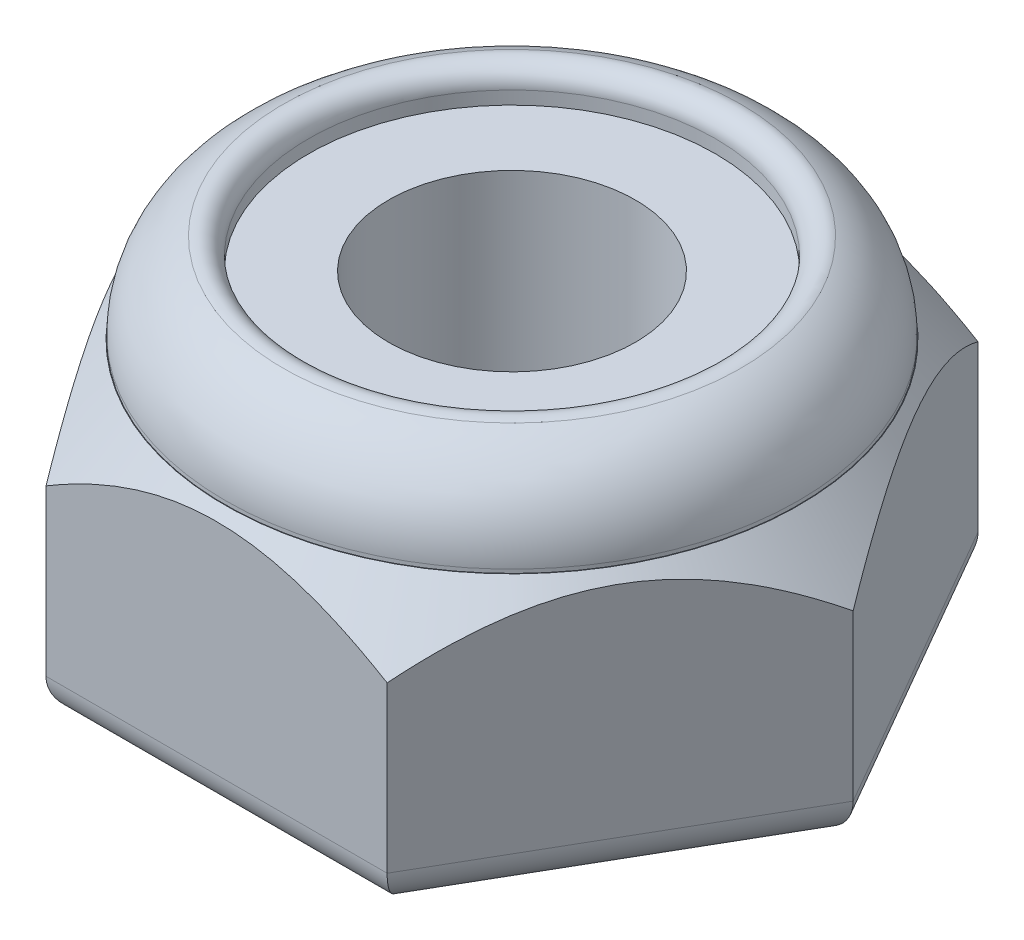
ISO-10303-21;
HEADER;
FILE_DESCRIPTION(('STEP AP214'),'2;1');
FILE_NAME('part.step','',(''),(''),'','','');
FILE_SCHEMA(('AUTOMOTIVE_DESIGN { 1 0 10303 214 1 1 1 1 }'));
ENDSEC;
DATA;
#1=APPLICATION_CONTEXT('core data for automotive mechanical design processes');
#2=APPLICATION_PROTOCOL_DEFINITION('international standard','automotive_design',2000,#1);
#3=PRODUCT_CONTEXT('',#1,'mechanical');
#4=PRODUCT('Part','Part','',(#3));
#5=PRODUCT_RELATED_PRODUCT_CATEGORY('part','',(#4));
#6=PRODUCT_DEFINITION_FORMATION('','',#4);
#7=PRODUCT_DEFINITION_CONTEXT('part definition',#1,'design');
#8=PRODUCT_DEFINITION('design','',#6,#7);
#9=PRODUCT_DEFINITION_SHAPE('','',#8);
#10=(LENGTH_UNIT() NAMED_UNIT(*) SI_UNIT(.MILLI.,.METRE.));
#11=(NAMED_UNIT(*) PLANE_ANGLE_UNIT() SI_UNIT($,.RADIAN.));
#12=(NAMED_UNIT(*) SI_UNIT($,.STERADIAN.) SOLID_ANGLE_UNIT());
#13=UNCERTAINTY_MEASURE_WITH_UNIT(LENGTH_MEASURE(1.E-05),#10,'distance_accuracy_value','');
#14=(GEOMETRIC_REPRESENTATION_CONTEXT(3) GLOBAL_UNCERTAINTY_ASSIGNED_CONTEXT((#13)) GLOBAL_UNIT_ASSIGNED_CONTEXT((#10,
#11,#12)) REPRESENTATION_CONTEXT('',''));
#15=CARTESIAN_POINT('',(0.,0.,0.));
#16=DIRECTION('',(0.,0.,1.));
#17=DIRECTION('',(1.,0.,0.));
#18=AXIS2_PLACEMENT_3D('',#15,#16,#17);
#19=CARTESIAN_POINT('',(0.,4.9784,0.));
#20=DIRECTION('',(0.,-1.,0.));
#21=DIRECTION('',(0.,0.,-1.));
#22=AXIS2_PLACEMENT_3D('',#19,#20,#21);
#23=CYLINDRICAL_SURFACE('',#22,3.937);
#24=CARTESIAN_POINT('',(0.,3.7084,0.));
#25=DIRECTION('',(0.,1.,0.));
#26=DIRECTION('',(0.,0.,1.));
#27=AXIS2_PLACEMENT_3D('',#24,#25,#26);
#28=CIRCLE('',#27,3.937);
#29=CARTESIAN_POINT('',(0.,3.7084,3.937));
#30=VERTEX_POINT('',#29);
#31=EDGE_CURVE('E243',#30,#30,#28,.T.);
#32=ORIENTED_EDGE('',*,*,#31,.F.);
#33=EDGE_LOOP('',(#32));
#34=FACE_BOUND('',#33,.T.);
#35=CARTESIAN_POINT('',(0.,3.6576,0.));
#36=DIRECTION('',(0.,-1.,0.));
#37=DIRECTION('',(0.,0.,-1.));
#38=AXIS2_PLACEMENT_3D('',#35,#36,#37);
#39=CIRCLE('',#38,3.937);
#40=CARTESIAN_POINT('',(0.,3.6576,-3.937));
#41=VERTEX_POINT('',#40);
#42=EDGE_CURVE('E19',#41,#41,#39,.F.);
#43=ORIENTED_EDGE('',*,*,#42,.T.);
#44=EDGE_LOOP('',(#43));
#45=FACE_BOUND('',#44,.T.);
#46=ADVANCED_FACE('F16',(#34,#45),#23,.T.);
#47=CARTESIAN_POINT('',(0.,3.7084,0.));
#48=DIRECTION('',(0.,1.,0.));
#49=DIRECTION('',(0.,0.,1.));
#50=AXIS2_PLACEMENT_3D('',#47,#48,#49);
#51=TOROIDAL_SURFACE('',#50,2.667,1.27);
#52=ORIENTED_EDGE('',*,*,#31,.T.);
#53=EDGE_LOOP('',(#52));
#54=FACE_BOUND('',#53,.T.);
#55=CARTESIAN_POINT('',(0.,4.88572150982644,0.));
#56=DIRECTION('',(0.,-1.,0.));
#57=DIRECTION('',(0.,0.,-1.));
#58=AXIS2_PLACEMENT_3D('',#55,#56,#57);
#59=CIRCLE('',#58,3.14325);
#60=CARTESIAN_POINT('',(0.,4.88572150982644,-3.14325));
#61=VERTEX_POINT('',#60);
#62=EDGE_CURVE('E237',#61,#61,#59,.F.);
#63=ORIENTED_EDGE('',*,*,#62,.F.);
#64=EDGE_LOOP('',(#63));
#65=FACE_BOUND('',#64,.T.);
#66=ADVANCED_FACE('F134',(#54,#65),#51,.T.);
#67=CARTESIAN_POINT('',(2.34315,3.6576,4.05845484975502));
#68=DIRECTION('',(0.,-1.,0.));
#69=DIRECTION('',(0.,0.,-1.));
#70=AXIS2_PLACEMENT_3D('',#67,#68,#69);
#71=PLANE('',#70);
#72=ORIENTED_EDGE('',*,*,#42,.F.);
#73=EDGE_LOOP('',(#72));
#74=FACE_BOUND('',#73,.T.);
#75=CARTESIAN_POINT('',(0.,3.65760000011051,0.));
#76=DIRECTION('',(0.,-1.,0.));
#77=DIRECTION('',(0.,0.,-1.));
#78=AXIS2_PLACEMENT_3D('',#75,#76,#77);
#79=CIRCLE('',#78,3.94407100938664);
#80=CARTESIAN_POINT('',(0.,3.65760000011051,-3.94407100938664));
#81=VERTEX_POINT('',#80);
#82=EDGE_CURVE('E119',#81,#81,#79,.T.);
#83=ORIENTED_EDGE('',*,*,#82,.F.);
#84=EDGE_LOOP('',(#83));
#85=FACE_BOUND('',#84,.T.);
#86=ADVANCED_FACE('F129',(#74,#85),#71,.F.);
#87=CARTESIAN_POINT('',(0.,4.65025720786115,0.));
#88=DIRECTION('',(0.,-1.,0.));
#89=DIRECTION('',(0.,0.,-1.));
#90=AXIS2_PLACEMENT_3D('',#87,#88,#89);
#91=TOROIDAL_SURFACE('',#90,3.048,0.254);
#92=CARTESIAN_POINT('',(0.,4.65025720786115,0.));
#93=DIRECTION('',(0.,1.,0.));
#94=DIRECTION('',(0.,0.,1.));
#95=AXIS2_PLACEMENT_3D('',#92,#93,#94);
#96=CIRCLE('',#95,2.794);
#97=CARTESIAN_POINT('',(0.,4.65025720786115,2.794));
#98=VERTEX_POINT('',#97);
#99=EDGE_CURVE('E104',#98,#98,#96,.F.);
#100=ORIENTED_EDGE('',*,*,#99,.T.);
#101=EDGE_LOOP('',(#100));
#102=FACE_BOUND('',#101,.T.);
#103=ORIENTED_EDGE('',*,*,#62,.T.);
#104=EDGE_LOOP('',(#103));
#105=FACE_BOUND('',#104,.T.);
#106=ADVANCED_FACE('F125',(#102,#105),#91,.T.);
#107=CARTESIAN_POINT('',(0.,2.76773860969115,0.));
#108=DIRECTION('',(0.,-1.,0.));
#109=DIRECTION('',(0.,0.,-1.));
#110=AXIS2_PLACEMENT_3D('',#107,#108,#109);
#111=CONICAL_SURFACE('',#110,4.69075337389313,0.698131700802158);
#112=CARTESIAN_POINT('',(-4.68630000001476,2.77304593398821,-5.3333815551093E-11));
#113=CARTESIAN_POINT('',(-4.65177717141793,2.81418235889091,0.0597952931149053));
#114=CARTESIAN_POINT('',(-4.61695780288956,2.85432113110728,0.120104208500933));
#115=CARTESIAN_POINT('',(-4.54666264441453,2.93230661020916,0.241858994511412));
#116=CARTESIAN_POINT('',(-4.51118655194523,2.97015222462005,0.303305389120424));
#117=CARTESIAN_POINT('',(-4.40329561885259,3.08018701500149,0.490177966909938));
#118=CARTESIAN_POINT('',(-4.32983334004397,3.14837015576205,0.617418366247689));
#119=CARTESIAN_POINT('',(-4.1797796499728,3.27092778609509,0.877318981315214));
#120=CARTESIAN_POINT('',(-4.10317943932402,3.32525984886677,1.00999443802899));
#121=CARTESIAN_POINT('',(-3.94747591651278,3.41577217646147,1.27968085045525));
#122=CARTESIAN_POINT('',(-3.86837998243724,3.45200143013375,1.4166790269463));
#123=CARTESIAN_POINT('',(-3.73746585196202,3.49372811243502,1.64342895235813));
#124=CARTESIAN_POINT('',(-3.68614686019516,3.50560413715319,1.73231605349153));
#125=CARTESIAN_POINT('',(-3.58316406708587,3.52008140702852,1.91068748346216));
#126=CARTESIAN_POINT('',(-3.53150020834088,3.5226810675312,2.00017191172355));
#127=CARTESIAN_POINT('',(-3.42855034551142,3.51847006524789,2.17848630477643));
#128=CARTESIAN_POINT('',(-3.3772638088531,3.51171021118305,2.26731719201287));
#129=CARTESIAN_POINT('',(-3.27519197708947,3.48921023555424,2.4441107906491));
#130=CARTESIAN_POINT('',(-3.22440670715057,3.4734696654174,2.53207345845939));
#131=CARTESIAN_POINT('',(-3.10963060134479,3.42817062222156,2.73087150520989));
#132=CARTESIAN_POINT('',(-3.04589899577138,3.39598542076133,2.84125788411098));
#133=CARTESIAN_POINT('',(-2.92018166739655,3.32004827846255,3.05900668424801));
#134=CARTESIAN_POINT('',(-2.85819691962206,3.27629001415058,3.16636741668776));
#135=CARTESIAN_POINT('',(-2.735889068299,3.17910361386979,3.37821082934389));
#136=CARTESIAN_POINT('',(-2.67557364738244,3.12563730731956,3.48268020285126));
#137=CARTESIAN_POINT('',(-2.55683004320588,3.01104764609313,3.68835015835892));
#138=CARTESIAN_POINT('',(-2.49840123089761,2.94992687749399,3.78955182990274));
#139=CARTESIAN_POINT('',(-2.42439626092569,2.86741854625153,3.91773219790672));
#140=CARTESIAN_POINT('',(-2.40802320106583,2.84883596648691,3.94609116945937));
#141=CARTESIAN_POINT('',(-2.3754621576302,2.81125673907332,4.00248855103733));
#142=CARTESIAN_POINT('',(-2.35927376441604,2.79226151161516,4.03052767057717));
#143=CARTESIAN_POINT('',(-2.3431499999717,2.77304593399368,4.05845484980404));
#144=B_SPLINE_CURVE_WITH_KNOTS('',3,(#112,#113,#114,#115,#116,#117,#118,#119,#120,#121,#122,
#123,#124,#125,#126,#127,#128,#129,#130,#131,#132,#133,#134,#135,#136,#137,#138,#139,#140,#141,
#142,#143),.UNSPECIFIED.,.F.,.F.,(4,2,2,2,2,2,2,2,2,2,2,2,2,2,2,4),(0.,0.241096809088565,
0.48230758945251,0.967637153847365,1.45443592242802,1.93991010956963,2.24950193433618,
2.5591466432483,2.86711700071403,3.17510274216898,3.56882084711336,3.96275452403261,
4.35827201930639,4.75365624679115,4.86660838982693,4.97921936905084),.UNSPECIFIED.);
#145=CARTESIAN_POINT('',(-4.68630000002839,2.77304593399358,0.));
#146=VERTEX_POINT('',#145);
#147=CARTESIAN_POINT('',(-2.34315000001419,2.77304593399358,4.05845484977959));
#148=VERTEX_POINT('',#147);
#149=EDGE_CURVE('E91',#146,#148,#144,.T.);
#150=ORIENTED_EDGE('',*,*,#149,.T.);
#151=CARTESIAN_POINT('',(-2.34315000005357,2.77304593398822,4.05845484974113));
#152=CARTESIAN_POINT('',(-2.27415972170409,2.81414935271336,4.05845484974989));
#153=CARTESIAN_POINT('',(-2.20457738522044,2.85425669884705,4.05845484975361));
#154=CARTESIAN_POINT('',(-2.06410193528096,2.93218331968193,4.05845484975642));
#155=CARTESIAN_POINT('',(-1.99320821641151,2.9700015013142,4.05845484975551));
#156=CARTESIAN_POINT('',(-1.77754688772429,3.07999086386455,4.05845484975401));
#157=CARTESIAN_POINT('',(-1.63068545869954,3.1481589403704,4.05845484975469));
#158=CARTESIAN_POINT('',(-1.33052752457963,3.27077676919262,4.05845484975534));
#159=CARTESIAN_POINT('',(-1.17720631609342,3.32516696804196,4.0584548497553));
#160=CARTESIAN_POINT('',(-0.865613503807779,3.41574608766059,4.05845484975473));
#161=CARTESIAN_POINT('',(-0.707359229311903,3.45199244874899,4.0584548497542));
#162=CARTESIAN_POINT('',(-0.456822143345071,3.49192146546895,4.05845484975548));
#163=CARTESIAN_POINT('',(-0.365672921156202,3.50290887295604,4.05845484975637));
#164=CARTESIAN_POINT('',(-0.183016322004482,3.51758027913678,4.05845484975366));
#165=CARTESIAN_POINT('',(-0.0915105175250817,3.52128341037061,4.05845484975007));
#166=CARTESIAN_POINT('',(0.104649468641441,3.52128177491765,4.0584548497495));
#167=CARTESIAN_POINT('',(0.209305100872023,3.51643705333648,4.05845484975354));
#168=CARTESIAN_POINT('',(0.417787181909869,3.49730239560235,4.05845484975649));
#169=CARTESIAN_POINT('',(0.521613181352877,3.48300765111694,4.05845484975541));
#170=CARTESIAN_POINT('',(0.728332544913562,3.44553375886282,4.05845484975462));
#171=CARTESIAN_POINT('',(0.831215331558566,3.42229697724238,4.05845484975491));
#172=CARTESIAN_POINT('',(1.03487580391125,3.36791830054733,4.05845484975512));
#173=CARTESIAN_POINT('',(1.13565289468809,3.33677420321768,4.05845484975504));
#174=CARTESIAN_POINT('',(1.33273383822163,3.26838741918099,4.05845484975499));
#175=CARTESIAN_POINT('',(1.42908716226035,3.23128582684656,4.05845484975501));
#176=CARTESIAN_POINT('',(1.61947291708309,3.15151071591982,4.05845484975502));
#177=CARTESIAN_POINT('',(1.71350470709807,3.10883567899407,4.05845484975502));
#178=CARTESIAN_POINT('',(1.89803195382395,3.01941532331662,4.05845484975501));
#179=CARTESIAN_POINT('',(1.98855798046432,2.97273255726059,4.05845484975502));
#180=CARTESIAN_POINT('',(2.16742834958163,2.87556944084479,4.05845484975502));
#181=CARTESIAN_POINT('',(2.25577492892455,2.82509321932285,4.05845484975502));
#182=CARTESIAN_POINT('',(2.34315000005566,2.77304593399424,4.05845484975502));
#183=B_SPLINE_CURVE_WITH_KNOTS('',3,(#151,#152,#153,#154,#155,#156,#157,#158,#159,#160,#161,
#162,#163,#164,#165,#166,#167,#168,#169,#170,#171,#172,#173,#174,#175,#176,#177,#178,#179,#180,
#181,#182),.UNSPECIFIED.,.F.,.F.,(4,2,2,2,2,2,2,2,2,2,2,2,2,2,2,4),(0.,0.24090330355952,
0.481920744736242,0.967059466968448,1.4542606837498,1.93990959177135,2.21507934695766,
2.4895253838939,2.80337599596431,3.11738642360394,3.43345557972405,3.74961286055439,
4.0591611810716,4.36879400620232,4.67425708545867,4.97939238068026),.UNSPECIFIED.);
#184=CARTESIAN_POINT('',(2.34315000001419,2.77304593399358,4.05845484977959));
#185=VERTEX_POINT('',#184);
#186=EDGE_CURVE('E83',#148,#185,#183,.T.);
#187=ORIENTED_EDGE('',*,*,#186,.T.);
#188=CARTESIAN_POINT('',(2.3431499999612,2.77304593398822,4.05845484979446));
#189=CARTESIAN_POINT('',(2.37767282857321,2.81418235889091,3.99865955663499));
#190=CARTESIAN_POINT('',(2.41249219710801,2.85432113110729,3.93835064125267));
#191=CARTESIAN_POINT('',(2.48278735558791,2.93230661020917,3.816595855245));
#192=CARTESIAN_POINT('',(2.51826344805563,2.97015222462005,3.75514946063508));
#193=CARTESIAN_POINT('',(2.62615438114571,3.08018701500149,3.56827688284408));
#194=CARTESIAN_POINT('',(2.69961665995557,3.14837015576206,3.44103648350706));
#195=CARTESIAN_POINT('',(2.84967035002766,3.2709277860951,3.18113586844006));
#196=CARTESIAN_POINT('',(2.9262705606761,3.32525984886677,3.04846041172609));
#197=CARTESIAN_POINT('',(3.08197408348711,3.41577217646148,2.77877399929969));
#198=CARTESIAN_POINT('',(3.16107001756274,3.45200143013376,2.64177582280869));
#199=CARTESIAN_POINT('',(3.291984148038,3.49372811243503,2.41502589739689));
#200=CARTESIAN_POINT('',(3.34330313980485,3.50560413715319,2.32613879626348));
#201=CARTESIAN_POINT('',(3.44628593291413,3.52008140702853,2.14776736629285));
#202=CARTESIAN_POINT('',(3.49794979165912,3.52268106753121,2.05828293803146));
#203=CARTESIAN_POINT('',(3.60089965448859,3.51847006524789,1.87996854497858));
#204=CARTESIAN_POINT('',(3.6521861911469,3.51171021118306,1.79113765774214));
#205=CARTESIAN_POINT('',(3.75425802291053,3.48921023555425,1.61434405910591));
#206=CARTESIAN_POINT('',(3.80504329284943,3.47346966541741,1.52638139129562));
#207=CARTESIAN_POINT('',(3.91981939865521,3.42817062222156,1.32758334454512));
#208=CARTESIAN_POINT('',(3.98355100422862,3.39598542076133,1.21719696564403));
#209=CARTESIAN_POINT('',(4.10926833260345,3.32004827846255,0.999448165506999));
#210=CARTESIAN_POINT('',(4.17125308037794,3.27629001415058,0.892087433067251));
#211=CARTESIAN_POINT('',(4.293560931701,3.17910361386979,0.680244020411125));
#212=CARTESIAN_POINT('',(4.35387635261756,3.12563730731956,0.575774646903749));
#213=CARTESIAN_POINT('',(4.47261995679412,3.01104764609313,0.370104691396086));
#214=CARTESIAN_POINT('',(4.53104876910239,2.94992687749399,0.268903019852268));
#215=CARTESIAN_POINT('',(4.60505373907431,2.86741854625153,0.140722651848287));
#216=CARTESIAN_POINT('',(4.62142679893417,2.84883596648691,0.112363680295636));
#217=CARTESIAN_POINT('',(4.6539878423698,2.81125673907332,0.055966298717677));
#218=CARTESIAN_POINT('',(4.67017623558396,2.79226151161516,0.0279271791778412));
#219=CARTESIAN_POINT('',(4.6863000000283,2.77304593399368,-4.90273860582746E-11));
#220=B_SPLINE_CURVE_WITH_KNOTS('',3,(#188,#189,#190,#191,#192,#193,#194,#195,#196,#197,#198,
#199,#200,#201,#202,#203,#204,#205,#206,#207,#208,#209,#210,#211,#212,#213,#214,#215,#216,#217,
#218,#219),.UNSPECIFIED.,.F.,.F.,(4,2,2,2,2,2,2,2,2,2,2,2,2,2,2,4),(0.,0.241096809088565,
0.48230758945251,0.967637153847363,1.45443592242802,1.93991010956962,2.24950193433617,
2.5591466432483,2.86711700071402,3.17510274216897,3.56882084711335,3.9627545240326,
4.35827201930639,4.75365624679114,4.86660838982692,4.97921936905084),.UNSPECIFIED.);
#221=CARTESIAN_POINT('',(4.68630000001419,2.7730459340105,-2.45821360759307E-11));
#222=VERTEX_POINT('',#221);
#223=EDGE_CURVE('E88',#185,#222,#220,.T.);
#224=ORIENTED_EDGE('',*,*,#223,.T.);
#225=CARTESIAN_POINT('',(4.68630000001476,2.77304593398822,5.33267015141622E-11));
#226=CARTESIAN_POINT('',(4.65177717141792,2.81418235889091,-0.0597952931149122));
#227=CARTESIAN_POINT('',(4.61695780288956,2.85432113110729,-0.12010420850094));
#228=CARTESIAN_POINT('',(4.54666264441452,2.93230661020917,-0.241858994511418));
#229=CARTESIAN_POINT('',(4.51118655194522,2.97015222462005,-0.303305389120429));
#230=CARTESIAN_POINT('',(4.40329561885258,3.0801870150015,-0.490177966909942));
#231=CARTESIAN_POINT('',(4.32983334004397,3.14837015576206,-0.617418366247694));
#232=CARTESIAN_POINT('',(4.1797796499728,3.27092778609509,-0.877318981315217));
#233=CARTESIAN_POINT('',(4.10317943932402,3.32525984886677,-1.00999443802899));
#234=CARTESIAN_POINT('',(3.94747591651277,3.41577217646148,-1.27968085045525));
#235=CARTESIAN_POINT('',(3.86837998243724,3.45200143013375,-1.4166790269463));
#236=CARTESIAN_POINT('',(3.73746585196202,3.49372811243502,-1.64342895235813));
#237=CARTESIAN_POINT('',(3.68614686019516,3.50560413715319,-1.73231605349153));
#238=CARTESIAN_POINT('',(3.58316406708587,3.52008140702852,-1.91068748346216));
#239=CARTESIAN_POINT('',(3.53150020834088,3.5226810675312,-2.00017191172355));
#240=CARTESIAN_POINT('',(3.42855034551142,3.51847006524789,-2.17848630477643));
#241=CARTESIAN_POINT('',(3.3772638088531,3.51171021118306,-2.26731719201287));
#242=CARTESIAN_POINT('',(3.27519197708948,3.48921023555424,-2.4441107906491));
#243=CARTESIAN_POINT('',(3.22440670715057,3.4734696654174,-2.53207345845939));
#244=CARTESIAN_POINT('',(3.10963060134479,3.42817062222156,-2.73087150520989));
#245=CARTESIAN_POINT('',(3.04589899577138,3.39598542076133,-2.84125788411098));
#246=CARTESIAN_POINT('',(2.92018166739655,3.32004827846255,-3.05900668424801));
#247=CARTESIAN_POINT('',(2.85819691962206,3.27629001415058,-3.16636741668776));
#248=CARTESIAN_POINT('',(2.735889068299,3.17910361386979,-3.37821082934388));
#249=CARTESIAN_POINT('',(2.67557364738245,3.12563730731956,-3.48268020285126));
#250=CARTESIAN_POINT('',(2.55683004320588,3.01104764609313,-3.68835015835892));
#251=CARTESIAN_POINT('',(2.49840123089762,2.94992687749399,-3.78955182990274));
#252=CARTESIAN_POINT('',(2.42439626092569,2.86741854625153,-3.91773219790672));
#253=CARTESIAN_POINT('',(2.40802320106583,2.84883596648691,-3.94609116945937));
#254=CARTESIAN_POINT('',(2.3754621576302,2.81125673907332,-4.00248855103733));
#255=CARTESIAN_POINT('',(2.35927376441604,2.79226151161516,-4.03052767057717));
#256=CARTESIAN_POINT('',(2.3431499999717,2.77304593399368,-4.05845484980404));
#257=B_SPLINE_CURVE_WITH_KNOTS('',3,(#225,#226,#227,#228,#229,#230,#231,#232,#233,#234,#235,
#236,#237,#238,#239,#240,#241,#242,#243,#244,#245,#246,#247,#248,#249,#250,#251,#252,#253,#254,
#255,#256),.UNSPECIFIED.,.F.,.F.,(4,2,2,2,2,2,2,2,2,2,2,2,2,2,2,4),(0.,0.241096809088564,
0.482307589452508,0.96763715384736,1.45443592242801,1.93991010956962,2.24950193433616,
2.55914664324829,2.86711700071401,3.17510274216896,3.56882084711335,3.96275452403259,
4.35827201930638,4.75365624679113,4.86660838982692,4.97921936905084),.UNSPECIFIED.);
#258=CARTESIAN_POINT('',(2.34315000001419,2.77304593399358,-4.0584548497796));
#259=VERTEX_POINT('',#258);
#260=EDGE_CURVE('E193',#222,#259,#257,.T.);
#261=ORIENTED_EDGE('',*,*,#260,.T.);
#262=CARTESIAN_POINT('',(2.34315000005357,2.77304593398821,-4.05845484974114));
#263=CARTESIAN_POINT('',(2.27415972170409,2.81414935271335,-4.05845484974989));
#264=CARTESIAN_POINT('',(2.20457738522045,2.85425669884704,-4.05845484975361));
#265=CARTESIAN_POINT('',(2.06410193528096,2.93218331968193,-4.05845484975643));
#266=CARTESIAN_POINT('',(1.99320821641151,2.97000150131419,-4.05845484975552));
#267=CARTESIAN_POINT('',(1.77754688772429,3.07999086386454,-4.05845484975402));
#268=CARTESIAN_POINT('',(1.63068545869954,3.1481589403704,-4.0584548497547));
#269=CARTESIAN_POINT('',(1.33052752457963,3.27077676919261,-4.05845484975534));
#270=CARTESIAN_POINT('',(1.17720631609342,3.32516696804195,-4.0584548497553));
#271=CARTESIAN_POINT('',(0.865613503807778,3.41574608766058,-4.05845484975474));
#272=CARTESIAN_POINT('',(0.707359229311901,3.45199244874898,-4.0584548497542));
#273=CARTESIAN_POINT('',(0.456822143345069,3.49192146546895,-4.05845484975548));
#274=CARTESIAN_POINT('',(0.365672921156201,3.50290887295604,-4.05845484975637));
#275=CARTESIAN_POINT('',(0.183016322004481,3.51758027913677,-4.05845484975367));
#276=CARTESIAN_POINT('',(0.0915105175250814,3.5212834103706,-4.05845484975008));
#277=CARTESIAN_POINT('',(-0.104649468641441,3.52128177491764,-4.0584548497495));
#278=CARTESIAN_POINT('',(-0.209305100872023,3.51643705333648,-4.05845484975354));
#279=CARTESIAN_POINT('',(-0.41778718190987,3.49730239560234,-4.0584548497565));
#280=CARTESIAN_POINT('',(-0.521613181352877,3.48300765111693,-4.05845484975542));
#281=CARTESIAN_POINT('',(-0.728332544913562,3.44553375886281,-4.05845484975462));
#282=CARTESIAN_POINT('',(-0.831215331558566,3.42229697724237,-4.05845484975491));
#283=CARTESIAN_POINT('',(-1.03487580391125,3.36791830054732,-4.05845484975513));
#284=CARTESIAN_POINT('',(-1.13565289468809,3.33677420321767,-4.05845484975505));
#285=CARTESIAN_POINT('',(-1.33273383822163,3.26838741918098,-4.05845484975499));
#286=CARTESIAN_POINT('',(-1.42908716226035,3.23128582684655,-4.05845484975501));
#287=CARTESIAN_POINT('',(-1.61947291708309,3.15151071591982,-4.05845484975503));
#288=CARTESIAN_POINT('',(-1.71350470709807,3.10883567899406,-4.05845484975502));
#289=CARTESIAN_POINT('',(-1.89803195382395,3.01941532331662,-4.05845484975502));
#290=CARTESIAN_POINT('',(-1.98855798046431,2.97273255726059,-4.05845484975502));
#291=CARTESIAN_POINT('',(-2.16742834958162,2.87556944084479,-4.05845484975502));
#292=CARTESIAN_POINT('',(-2.25577492892455,2.82509321932284,-4.05845484975502));
#293=CARTESIAN_POINT('',(-2.34315000005566,2.77304593399424,-4.05845484975502));
#294=B_SPLINE_CURVE_WITH_KNOTS('',3,(#262,#263,#264,#265,#266,#267,#268,#269,#270,#271,#272,
#273,#274,#275,#276,#277,#278,#279,#280,#281,#282,#283,#284,#285,#286,#287,#288,#289,#290,#291,
#292,#293),.UNSPECIFIED.,.F.,.F.,(4,2,2,2,2,2,2,2,2,2,2,2,2,2,2,4),(0.,0.24090330355952,
0.481920744736243,0.96705946696845,1.4542606837498,1.93990959177135,2.21507934695766,
2.48952538389391,2.80337599596432,3.11738642360394,3.43345557972405,3.74961286055439,
4.0591611810716,4.36879400620232,4.67425708545866,4.97939238068026),.UNSPECIFIED.);
#295=CARTESIAN_POINT('',(-2.34315000001419,2.77304593399358,-4.0584548497796));
#296=VERTEX_POINT('',#295);
#297=EDGE_CURVE('E203',#259,#296,#294,.T.);
#298=ORIENTED_EDGE('',*,*,#297,.T.);
#299=CARTESIAN_POINT('',(-2.3431499999612,2.77304593398821,-4.05845484979447));
#300=CARTESIAN_POINT('',(-2.37767282857321,2.81418235889091,-3.99865955663499));
#301=CARTESIAN_POINT('',(-2.41249219710802,2.85432113110728,-3.93835064125268));
#302=CARTESIAN_POINT('',(-2.48278735558791,2.93230661020916,-3.81659585524501));
#303=CARTESIAN_POINT('',(-2.51826344805563,2.97015222462005,-3.75514946063508));
#304=CARTESIAN_POINT('',(-2.62615438114571,3.08018701500149,-3.56827688284409));
#305=CARTESIAN_POINT('',(-2.69961665995557,3.14837015576205,-3.44103648350706));
#306=CARTESIAN_POINT('',(-2.84967035002766,3.27092778609509,-3.18113586844007));
#307=CARTESIAN_POINT('',(-2.9262705606761,3.32525984886676,-3.0484604117261));
#308=CARTESIAN_POINT('',(-3.08197408348711,3.41577217646147,-2.7787739992997));
#309=CARTESIAN_POINT('',(-3.16107001756274,3.45200143013375,-2.6417758228087));
#310=CARTESIAN_POINT('',(-3.291984148038,3.49372811243502,-2.4150258973969));
#311=CARTESIAN_POINT('',(-3.34330313980485,3.50560413715318,-2.32613879626349));
#312=CARTESIAN_POINT('',(-3.44628593291413,3.52008140702852,-2.14776736629286));
#313=CARTESIAN_POINT('',(-3.49794979165912,3.5226810675312,-2.05828293803147));
#314=CARTESIAN_POINT('',(-3.60089965448859,3.51847006524788,-1.87996854497859));
#315=CARTESIAN_POINT('',(-3.6521861911469,3.51171021118305,-1.79113765774214));
#316=CARTESIAN_POINT('',(-3.75425802291053,3.48921023555424,-1.61434405910592));
#317=CARTESIAN_POINT('',(-3.80504329284944,3.4734696654174,-1.52638139129563));
#318=CARTESIAN_POINT('',(-3.91981939865521,3.42817062222155,-1.32758334454512));
#319=CARTESIAN_POINT('',(-3.98355100422863,3.39598542076132,-1.21719696564403));
#320=CARTESIAN_POINT('',(-4.10926833260346,3.32004827846254,-0.999448165507007));
#321=CARTESIAN_POINT('',(-4.17125308037794,3.27629001415057,-0.892087433067258));
#322=CARTESIAN_POINT('',(-4.29356093170101,3.17910361386978,-0.680244020411132));
#323=CARTESIAN_POINT('',(-4.35387635261756,3.12563730731955,-0.575774646903757));
#324=CARTESIAN_POINT('',(-4.47261995679413,3.01104764609312,-0.370104691396094));
#325=CARTESIAN_POINT('',(-4.53104876910239,2.94992687749399,-0.268903019852276));
#326=CARTESIAN_POINT('',(-4.60505373907432,2.86741854625152,-0.140722651848295));
#327=CARTESIAN_POINT('',(-4.62142679893418,2.84883596648691,-0.112363680295645));
#328=CARTESIAN_POINT('',(-4.6539878423698,2.81125673907331,-0.0559662987176857));
#329=CARTESIAN_POINT('',(-4.67017623558397,2.79226151161515,-0.0279271791778497));
#330=CARTESIAN_POINT('',(-4.68630000002831,2.77304593399367,4.90190782069009E-11));
#331=B_SPLINE_CURVE_WITH_KNOTS('',3,(#299,#300,#301,#302,#303,#304,#305,#306,#307,#308,#309,
#310,#311,#312,#313,#314,#315,#316,#317,#318,#319,#320,#321,#322,#323,#324,#325,#326,#327,#328,
#329,#330),.UNSPECIFIED.,.F.,.F.,(4,2,2,2,2,2,2,2,2,2,2,2,2,2,2,4),(0.,0.241096809088564,
0.482307589452509,0.967637153847362,1.45443592242802,1.93991010956962,2.24950193433617,
2.5591466432483,2.86711700071402,3.17510274216897,3.56882084711335,3.9627545240326,
4.35827201930639,4.75365624679114,4.86660838982692,4.97921936905084),.UNSPECIFIED.);
#332=EDGE_CURVE('E209',#296,#146,#331,.T.);
#333=ORIENTED_EDGE('',*,*,#332,.T.);
#334=EDGE_LOOP('',(#150,#187,#224,#261,#298,#333));
#335=FACE_BOUND('',#334,.T.);
#336=ORIENTED_EDGE('',*,*,#82,.T.);
#337=EDGE_LOOP('',(#336));
#338=FACE_BOUND('',#337,.T.);
#339=ADVANCED_FACE('F85',(#335,#338),#111,.T.);
#340=CARTESIAN_POINT('',(0.,4.4704,0.));
#341=DIRECTION('',(0.,1.,0.));
#342=DIRECTION('',(0.,0.,1.));
#343=AXIS2_PLACEMENT_3D('',#340,#341,#342);
#344=CYLINDRICAL_SURFACE('',#343,2.794);
#345=ORIENTED_EDGE('',*,*,#99,.F.);
#346=EDGE_LOOP('',(#345));
#347=FACE_BOUND('',#346,.T.);
#348=CARTESIAN_POINT('',(0.,4.4704,0.));
#349=DIRECTION('',(0.,1.,0.));
#350=DIRECTION('',(0.,0.,1.));
#351=AXIS2_PLACEMENT_3D('',#348,#349,#350);
#352=CIRCLE('',#351,2.794);
#353=CARTESIAN_POINT('',(0.,4.4704,2.794));
#354=VERTEX_POINT('',#353);
#355=EDGE_CURVE('E201',#354,#354,#352,.T.);
#356=ORIENTED_EDGE('',*,*,#355,.F.);
#357=EDGE_LOOP('',(#356));
#358=FACE_BOUND('',#357,.T.);
#359=ADVANCED_FACE('F375',(#347,#358),#344,.F.);
#360=CARTESIAN_POINT('',(2.34315,3.6576,4.05845484975502));
#361=DIRECTION('',(-0.866025403784439,0.,-0.499999999999999));
#362=DIRECTION('',(-0.499999999999999,0.,0.866025403784439));
#363=AXIS2_PLACEMENT_3D('',#360,#361,#362);
#364=PLANE('',#363);
#365=DIRECTION('',(-0.499999999999999,0.,0.866025403784439));
#366=VECTOR('',#365,1.);
#367=CARTESIAN_POINT('',(2.34315,0.508,4.05845484975502));
#368=LINE('',#367,#366);
#369=CARTESIAN_POINT('',(4.6863,0.508,0.));
#370=VERTEX_POINT('',#369);
#371=CARTESIAN_POINT('',(2.34315000000001,0.508,4.05845484975502));
#372=VERTEX_POINT('',#371);
#373=EDGE_CURVE('E267',#370,#372,#368,.T.);
#374=ORIENTED_EDGE('',*,*,#373,.F.);
#375=DIRECTION('',(0.,1.,0.));
#376=VECTOR('',#375,1.);
#377=CARTESIAN_POINT('',(4.6863,3.6576,0.));
#378=LINE('',#377,#376);
#379=EDGE_CURVE('E102',#370,#222,#378,.T.);
#380=ORIENTED_EDGE('',*,*,#379,.T.);
#381=ORIENTED_EDGE('',*,*,#223,.F.);
#382=DIRECTION('',(0.,1.,0.));
#383=VECTOR('',#382,1.);
#384=CARTESIAN_POINT('',(2.34315000000001,3.6576,4.05845484975502));
#385=LINE('',#384,#383);
#386=EDGE_CURVE('E95',#185,#372,#385,.F.);
#387=ORIENTED_EDGE('',*,*,#386,.T.);
#388=EDGE_LOOP('',(#374,#380,#381,#387));
#389=FACE_BOUND('',#388,.T.);
#390=ADVANCED_FACE('F99',(#389),#364,.F.);
#391=CARTESIAN_POINT('',(-2.34315,3.6576,4.05845484975501));
#392=DIRECTION('',(0.,0.,-1.));
#393=DIRECTION('',(-1.,0.,0.));
#394=AXIS2_PLACEMENT_3D('',#391,#392,#393);
#395=PLANE('',#394);
#396=DIRECTION('',(-1.,0.,0.));
#397=VECTOR('',#396,1.);
#398=CARTESIAN_POINT('',(-2.34315,0.508,4.05845484975501));
#399=LINE('',#398,#397);
#400=CARTESIAN_POINT('',(-2.34315,0.508,4.05845484975501));
#401=VERTEX_POINT('',#400);
#402=EDGE_CURVE('E109',#372,#401,#399,.T.);
#403=ORIENTED_EDGE('',*,*,#402,.F.);
#404=ORIENTED_EDGE('',*,*,#386,.F.);
#405=ORIENTED_EDGE('',*,*,#186,.F.);
#406=DIRECTION('',(0.,1.,0.));
#407=VECTOR('',#406,1.);
#408=CARTESIAN_POINT('',(-2.34315,3.6576,4.05845484975501));
#409=LINE('',#408,#407);
#410=EDGE_CURVE('E112',#148,#401,#409,.F.);
#411=ORIENTED_EDGE('',*,*,#410,.T.);
#412=EDGE_LOOP('',(#403,#404,#405,#411));
#413=FACE_BOUND('',#412,.T.);
#414=ADVANCED_FACE('F107',(#413),#395,.F.);
#415=CARTESIAN_POINT('',(-4.6863,3.6576,0.));
#416=DIRECTION('',(0.866025403784439,0.,-0.5));
#417=DIRECTION('',(-0.5,0.,-0.866025403784439));
#418=AXIS2_PLACEMENT_3D('',#415,#416,#417);
#419=PLANE('',#418);
#420=DIRECTION('',(-0.5,0.,-0.866025403784439));
#421=VECTOR('',#420,1.);
#422=CARTESIAN_POINT('',(-4.6863,0.508,0.));
#423=LINE('',#422,#421);
#424=CARTESIAN_POINT('',(-4.6863,0.508,0.));
#425=VERTEX_POINT('',#424);
#426=EDGE_CURVE('E263',#401,#425,#423,.T.);
#427=ORIENTED_EDGE('',*,*,#426,.F.);
#428=ORIENTED_EDGE('',*,*,#410,.F.);
#429=ORIENTED_EDGE('',*,*,#149,.F.);
#430=DIRECTION('',(0.,1.,0.));
#431=VECTOR('',#430,1.);
#432=CARTESIAN_POINT('',(-4.6863,3.6576,0.));
#433=LINE('',#432,#431);
#434=EDGE_CURVE('E208',#146,#425,#433,.F.);
#435=ORIENTED_EDGE('',*,*,#434,.T.);
#436=EDGE_LOOP('',(#427,#428,#429,#435));
#437=FACE_BOUND('',#436,.T.);
#438=ADVANCED_FACE('F220',(#437),#419,.F.);
#439=CARTESIAN_POINT('',(-2.34315,3.6576,-4.05845484975502));
#440=DIRECTION('',(0.866025403784438,0.,0.5));
#441=DIRECTION('',(0.5,0.,-0.866025403784438));
#442=AXIS2_PLACEMENT_3D('',#439,#440,#441);
#443=PLANE('',#442);
#444=DIRECTION('',(0.5,0.,-0.866025403784438));
#445=VECTOR('',#444,1.);
#446=CARTESIAN_POINT('',(-2.34315,0.508,-4.05845484975502));
#447=LINE('',#446,#445);
#448=CARTESIAN_POINT('',(-2.34315,0.508,-4.05845484975502));
#449=VERTEX_POINT('',#448);
#450=EDGE_CURVE('E259',#425,#449,#447,.T.);
#451=ORIENTED_EDGE('',*,*,#450,.F.);
#452=ORIENTED_EDGE('',*,*,#434,.F.);
#453=ORIENTED_EDGE('',*,*,#332,.F.);
#454=DIRECTION('',(0.,1.,0.));
#455=VECTOR('',#454,1.);
#456=CARTESIAN_POINT('',(-2.34315,3.6576,-4.05845484975502));
#457=LINE('',#456,#455);
#458=EDGE_CURVE('E200',#296,#449,#457,.F.);
#459=ORIENTED_EDGE('',*,*,#458,.T.);
#460=EDGE_LOOP('',(#451,#452,#453,#459));
#461=FACE_BOUND('',#460,.T.);
#462=ADVANCED_FACE('F217',(#461),#443,.F.);
#463=CARTESIAN_POINT('',(2.34315,3.6576,-4.05845484975502));
#464=DIRECTION('',(0.,0.,1.));
#465=DIRECTION('',(1.,0.,0.));
#466=AXIS2_PLACEMENT_3D('',#463,#464,#465);
#467=PLANE('',#466);
#468=DIRECTION('',(1.,0.,0.));
#469=VECTOR('',#468,1.);
#470=CARTESIAN_POINT('',(2.34315,0.508,-4.05845484975502));
#471=LINE('',#470,#469);
#472=CARTESIAN_POINT('',(2.34315,0.508,-4.05845484975502));
#473=VERTEX_POINT('',#472);
#474=EDGE_CURVE('E255',#449,#473,#471,.T.);
#475=ORIENTED_EDGE('',*,*,#474,.F.);
#476=ORIENTED_EDGE('',*,*,#458,.F.);
#477=ORIENTED_EDGE('',*,*,#297,.F.);
#478=DIRECTION('',(0.,1.,0.));
#479=VECTOR('',#478,1.);
#480=CARTESIAN_POINT('',(2.34315,3.6576,-4.05845484975501));
#481=LINE('',#480,#479);
#482=EDGE_CURVE('E199',#259,#473,#481,.F.);
#483=ORIENTED_EDGE('',*,*,#482,.T.);
#484=EDGE_LOOP('',(#475,#476,#477,#483));
#485=FACE_BOUND('',#484,.T.);
#486=ADVANCED_FACE('F188',(#485),#467,.F.);
#487=CARTESIAN_POINT('',(4.6863,3.6576,0.));
#488=DIRECTION('',(-0.866025403784439,0.,0.5));
#489=DIRECTION('',(0.5,0.,0.866025403784439));
#490=AXIS2_PLACEMENT_3D('',#487,#488,#489);
#491=PLANE('',#490);
#492=DIRECTION('',(0.5,0.,0.866025403784439));
#493=VECTOR('',#492,1.);
#494=CARTESIAN_POINT('',(4.6863,0.508,0.));
#495=LINE('',#494,#493);
#496=EDGE_CURVE('E253',#473,#370,#495,.T.);
#497=ORIENTED_EDGE('',*,*,#496,.F.);
#498=ORIENTED_EDGE('',*,*,#482,.F.);
#499=ORIENTED_EDGE('',*,*,#260,.F.);
#500=ORIENTED_EDGE('',*,*,#379,.F.);
#501=EDGE_LOOP('',(#497,#498,#499,#500));
#502=FACE_BOUND('',#501,.T.);
#503=ADVANCED_FACE('F183',(#502),#491,.F.);
#504=CARTESIAN_POINT('',(0.,4.4704,0.));
#505=DIRECTION('',(0.,1.,0.));
#506=DIRECTION('',(0.,0.,1.));
#507=AXIS2_PLACEMENT_3D('',#504,#505,#506);
#508=PLANE('',#507);
#509=CARTESIAN_POINT('',(0.,4.4704,0.));
#510=DIRECTION('',(0.,1.,0.));
#511=DIRECTION('',(0.,0.,1.));
#512=AXIS2_PLACEMENT_3D('',#509,#510,#511);
#513=CIRCLE('',#512,1.69545);
#514=CARTESIAN_POINT('',(0.,4.4704,1.69545));
#515=VERTEX_POINT('',#514);
#516=EDGE_CURVE('E246',#515,#515,#513,.F.);
#517=ORIENTED_EDGE('',*,*,#516,.T.);
#518=EDGE_LOOP('',(#517));
#519=FACE_BOUND('',#518,.T.);
#520=ORIENTED_EDGE('',*,*,#355,.T.);
#521=EDGE_LOOP('',(#520));
#522=FACE_BOUND('',#521,.T.);
#523=ADVANCED_FACE('F179',(#519,#522),#508,.T.);
#524=CARTESIAN_POINT('',(1.9032090948775,0.508,3.80445484975502));
#525=DIRECTION('',(-0.499999999999999,0.,0.866025403784439));
#526=DIRECTION('',(0.866025403784439,0.,0.499999999999999));
#527=AXIS2_PLACEMENT_3D('',#524,#525,#526);
#528=CYLINDRICAL_SURFACE('',#527,0.508);
#529=CARTESIAN_POINT('',(2.04985606325167,0.508,3.55045484975502));
#530=DIRECTION('',(-0.866025403784439,0.,0.5));
#531=DIRECTION('',(-0.5,0.,-0.866025403784439));
#532=AXIS2_PLACEMENT_3D('',#529,#530,#531);
#533=ELLIPSE('',#532,0.58658787349666,0.508);
#534=CARTESIAN_POINT('',(2.04985606325167,0.,3.55045484975502));
#535=VERTEX_POINT('',#534);
#536=EDGE_CURVE('E266',#535,#372,#533,.T.);
#537=ORIENTED_EDGE('',*,*,#536,.F.);
#538=DIRECTION('',(-0.499999999999999,0.,0.866025403784439));
#539=VECTOR('',#538,1.);
#540=CARTESIAN_POINT('',(4.09971212650334,0.,0.));
#541=LINE('',#540,#539);
#542=CARTESIAN_POINT('',(4.09971212650334,0.,0.));
#543=VERTEX_POINT('',#542);
#544=EDGE_CURVE('E249',#543,#535,#541,.T.);
#545=ORIENTED_EDGE('',*,*,#544,.F.);
#546=CARTESIAN_POINT('',(4.09971212650334,0.508,0.));
#547=DIRECTION('',(0.,0.,1.));
#548=DIRECTION('',(1.,0.,0.));
#549=AXIS2_PLACEMENT_3D('',#546,#547,#548);
#550=ELLIPSE('',#549,0.58658787349666,0.508);
#551=EDGE_CURVE('E250',#370,#543,#550,.F.);
#552=ORIENTED_EDGE('',*,*,#551,.F.);
#553=ORIENTED_EDGE('',*,*,#373,.T.);
#554=EDGE_LOOP('',(#537,#545,#552,#553));
#555=FACE_BOUND('',#554,.T.);
#556=ADVANCED_FACE('F175',(#555),#528,.T.);
#557=CARTESIAN_POINT('',(-2.34315,0.508,3.55045484975501));
#558=DIRECTION('',(-1.,0.,0.));
#559=DIRECTION('',(0.,0.,1.));
#560=AXIS2_PLACEMENT_3D('',#557,#558,#559);
#561=CYLINDRICAL_SURFACE('',#560,0.508);
#562=ORIENTED_EDGE('',*,*,#536,.T.);
#563=ORIENTED_EDGE('',*,*,#402,.T.);
#564=CARTESIAN_POINT('',(-2.04985606325167,0.508,3.55045484975501));
#565=DIRECTION('',(-0.866025403784439,0.,-0.5));
#566=DIRECTION('',(0.5,0.,-0.866025403784439));
#567=AXIS2_PLACEMENT_3D('',#564,#565,#566);
#568=ELLIPSE('',#567,0.58658787349666,0.508);
#569=CARTESIAN_POINT('',(-2.04985606325167,0.,3.55045484975502));
#570=VERTEX_POINT('',#569);
#571=EDGE_CURVE('E264',#570,#401,#568,.T.);
#572=ORIENTED_EDGE('',*,*,#571,.F.);
#573=DIRECTION('',(1.,0.,0.));
#574=VECTOR('',#573,1.);
#575=CARTESIAN_POINT('',(2.34315,0.,3.55045484975502));
#576=LINE('',#575,#574);
#577=EDGE_CURVE('E298',#535,#570,#576,.F.);
#578=ORIENTED_EDGE('',*,*,#577,.F.);
#579=EDGE_LOOP('',(#562,#563,#572,#578));
#580=FACE_BOUND('',#579,.T.);
#581=ADVANCED_FACE('F171',(#580),#561,.T.);
#582=CARTESIAN_POINT('',(-4.24635909487751,0.508,-0.254000000000004));
#583=DIRECTION('',(-0.5,0.,-0.866025403784439));
#584=DIRECTION('',(-0.866025403784439,0.,0.5));
#585=AXIS2_PLACEMENT_3D('',#582,#583,#584);
#586=CYLINDRICAL_SURFACE('',#585,0.508);
#587=ORIENTED_EDGE('',*,*,#571,.T.);
#588=ORIENTED_EDGE('',*,*,#426,.T.);
#589=CARTESIAN_POINT('',(-4.09971212650334,0.508,0.));
#590=DIRECTION('',(0.,0.,-1.));
#591=DIRECTION('',(1.,0.,0.));
#592=AXIS2_PLACEMENT_3D('',#589,#590,#591);
#593=ELLIPSE('',#592,0.58658787349666,0.508);
#594=CARTESIAN_POINT('',(-4.09971212650334,0.,0.));
#595=VERTEX_POINT('',#594);
#596=EDGE_CURVE('E260',#595,#425,#593,.T.);
#597=ORIENTED_EDGE('',*,*,#596,.F.);
#598=DIRECTION('',(-0.5,0.,-0.866025403784439));
#599=VECTOR('',#598,1.);
#600=CARTESIAN_POINT('',(-2.04985606325167,0.,3.55045484975501));
#601=LINE('',#600,#599);
#602=EDGE_CURVE('E294',#570,#595,#601,.T.);
#603=ORIENTED_EDGE('',*,*,#602,.F.);
#604=EDGE_LOOP('',(#587,#588,#597,#603));
#605=FACE_BOUND('',#604,.T.);
#606=ADVANCED_FACE('F167',(#605),#586,.T.);
#607=CARTESIAN_POINT('',(-1.90320909487751,0.508,-3.80445484975502));
#608=DIRECTION('',(0.5,0.,-0.866025403784438));
#609=DIRECTION('',(-0.866025403784438,0.,-0.5));
#610=AXIS2_PLACEMENT_3D('',#607,#608,#609);
#611=CYLINDRICAL_SURFACE('',#610,0.508);
#612=ORIENTED_EDGE('',*,*,#596,.T.);
#613=ORIENTED_EDGE('',*,*,#450,.T.);
#614=CARTESIAN_POINT('',(-2.04985606325167,0.508,-3.55045484975502));
#615=DIRECTION('',(0.866025403784439,0.,-0.5));
#616=DIRECTION('',(0.5,0.,0.866025403784439));
#617=AXIS2_PLACEMENT_3D('',#614,#615,#616);
#618=ELLIPSE('',#617,0.58658787349666,0.508);
#619=CARTESIAN_POINT('',(-2.04985606325167,0.,-3.55045484975502));
#620=VERTEX_POINT('',#619);
#621=EDGE_CURVE('E256',#620,#449,#618,.T.);
#622=ORIENTED_EDGE('',*,*,#621,.F.);
#623=DIRECTION('',(0.5,0.,-0.866025403784438));
#624=VECTOR('',#623,1.);
#625=CARTESIAN_POINT('',(-4.09971212650334,0.,0.));
#626=LINE('',#625,#624);
#627=EDGE_CURVE('E290',#595,#620,#626,.T.);
#628=ORIENTED_EDGE('',*,*,#627,.F.);
#629=EDGE_LOOP('',(#612,#613,#622,#628));
#630=FACE_BOUND('',#629,.T.);
#631=ADVANCED_FACE('F164',(#630),#611,.T.);
#632=CARTESIAN_POINT('',(2.34315,0.508,-3.55045484975502));
#633=DIRECTION('',(1.,0.,0.));
#634=DIRECTION('',(0.,0.,-1.));
#635=AXIS2_PLACEMENT_3D('',#632,#633,#634);
#636=CYLINDRICAL_SURFACE('',#635,0.508);
#637=ORIENTED_EDGE('',*,*,#621,.T.);
#638=ORIENTED_EDGE('',*,*,#474,.T.);
#639=CARTESIAN_POINT('',(2.04985606325167,0.508,-3.55045484975502));
#640=DIRECTION('',(0.866025403784439,0.,0.5));
#641=DIRECTION('',(-0.5,0.,0.866025403784439));
#642=AXIS2_PLACEMENT_3D('',#639,#640,#641);
#643=ELLIPSE('',#642,0.58658787349666,0.508);
#644=CARTESIAN_POINT('',(2.04985606325167,0.,-3.55045484975502));
#645=VERTEX_POINT('',#644);
#646=EDGE_CURVE('E34',#645,#473,#643,.T.);
#647=ORIENTED_EDGE('',*,*,#646,.F.);
#648=DIRECTION('',(1.,0.,0.));
#649=VECTOR('',#648,1.);
#650=CARTESIAN_POINT('',(2.34315,0.,-3.55045484975502));
#651=LINE('',#650,#649);
#652=EDGE_CURVE('E293',#620,#645,#651,.T.);
#653=ORIENTED_EDGE('',*,*,#652,.F.);
#654=EDGE_LOOP('',(#637,#638,#647,#653));
#655=FACE_BOUND('',#654,.T.);
#656=ADVANCED_FACE('F160',(#655),#636,.T.);
#657=CARTESIAN_POINT('',(4.2463590948775,0.508,0.253999999999996));
#658=DIRECTION('',(0.5,0.,0.866025403784439));
#659=DIRECTION('',(0.866025403784439,0.,-0.5));
#660=AXIS2_PLACEMENT_3D('',#657,#658,#659);
#661=CYLINDRICAL_SURFACE('',#660,0.508);
#662=ORIENTED_EDGE('',*,*,#551,.T.);
#663=DIRECTION('',(0.5,0.,0.866025403784439));
#664=VECTOR('',#663,1.);
#665=CARTESIAN_POINT('',(2.04985606325167,0.,-3.55045484975502));
#666=LINE('',#665,#664);
#667=EDGE_CURVE('E25',#645,#543,#666,.T.);
#668=ORIENTED_EDGE('',*,*,#667,.F.);
#669=ORIENTED_EDGE('',*,*,#646,.T.);
#670=ORIENTED_EDGE('',*,*,#496,.T.);
#671=EDGE_LOOP('',(#662,#668,#669,#670));
#672=FACE_BOUND('',#671,.T.);
#673=ADVANCED_FACE('F153',(#672),#661,.T.);
#674=CARTESIAN_POINT('',(0.,0.,0.));
#675=DIRECTION('',(0.,1.,0.));
#676=DIRECTION('',(0.,0.,1.));
#677=AXIS2_PLACEMENT_3D('',#674,#675,#676);
#678=CYLINDRICAL_SURFACE('',#677,1.69545);
#679=ORIENTED_EDGE('',*,*,#516,.F.);
#680=EDGE_LOOP('',(#679));
#681=FACE_BOUND('',#680,.T.);
#682=CARTESIAN_POINT('',(0.,0.,0.));
#683=DIRECTION('',(0.,1.,0.));
#684=DIRECTION('',(0.,0.,1.));
#685=AXIS2_PLACEMENT_3D('',#682,#683,#684);
#686=CIRCLE('',#685,1.69545);
#687=CARTESIAN_POINT('',(0.,0.,1.69545));
#688=VERTEX_POINT('',#687);
#689=EDGE_CURVE('E10',#688,#688,#686,.T.);
#690=ORIENTED_EDGE('',*,*,#689,.F.);
#691=EDGE_LOOP('',(#690));
#692=FACE_BOUND('',#691,.T.);
#693=ADVANCED_FACE('F147',(#681,#692),#678,.F.);
#694=CARTESIAN_POINT('',(2.34315,0.,4.05845484975502));
#695=DIRECTION('',(0.,-1.,0.));
#696=DIRECTION('',(0.,0.,-1.));
#697=AXIS2_PLACEMENT_3D('',#694,#695,#696);
#698=PLANE('',#697);
#699=ORIENTED_EDGE('',*,*,#689,.T.);
#700=EDGE_LOOP('',(#699));
#701=FACE_BOUND('',#700,.T.);
#702=ORIENTED_EDGE('',*,*,#652,.T.);
#703=ORIENTED_EDGE('',*,*,#667,.T.);
#704=ORIENTED_EDGE('',*,*,#544,.T.);
#705=ORIENTED_EDGE('',*,*,#577,.T.);
#706=ORIENTED_EDGE('',*,*,#602,.T.);
#707=ORIENTED_EDGE('',*,*,#627,.T.);
#708=EDGE_LOOP('',(#702,#703,#704,#705,#706,#707));
#709=FACE_BOUND('',#708,.T.);
#710=ADVANCED_FACE('F145',(#701,#709),#698,.T.);
#711=CLOSED_SHELL('',(#46,#66,#86,#106,#339,#359,#390,#414,#438,#462,#486,#503,#523,#556,#581,
#606,#631,#656,#673,#693,#710));
#712=MANIFOLD_SOLID_BREP('B1',#711);
#713=ADVANCED_BREP_SHAPE_REPRESENTATION('',(#18,#712),#14);
#714=SHAPE_DEFINITION_REPRESENTATION(#9,#713);
ENDSEC;
END-ISO-10303-21;
